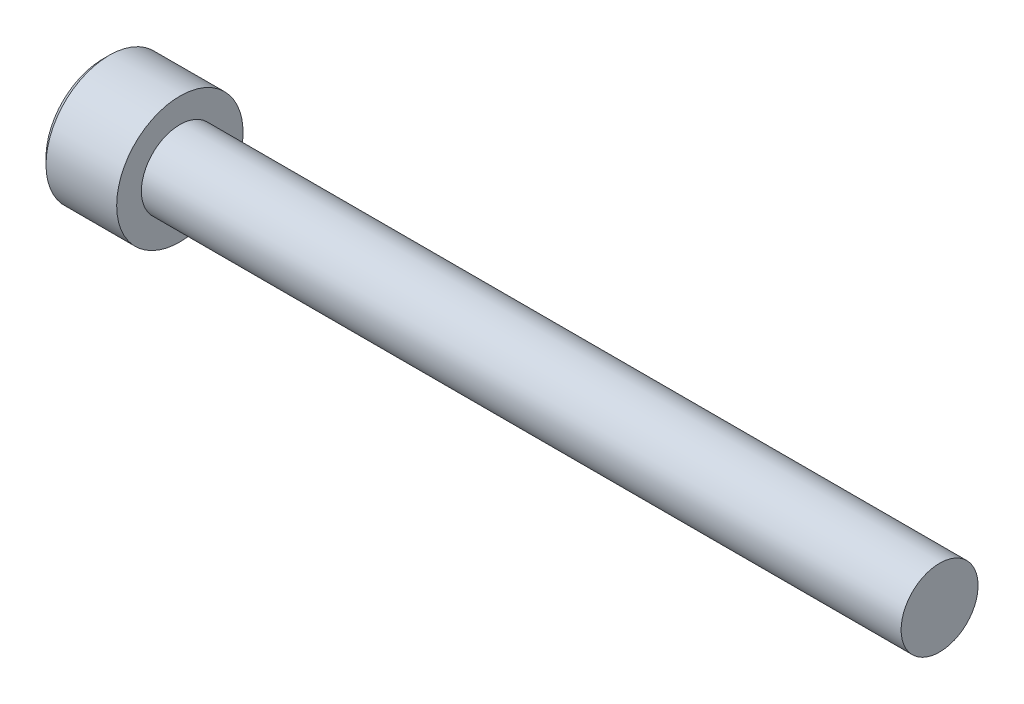
ISO-10303-21;
HEADER;
FILE_DESCRIPTION(('STEP AP214'),'2;1');
FILE_NAME('part.step','',(''),(''),'','','');
FILE_SCHEMA(('AUTOMOTIVE_DESIGN { 1 0 10303 214 1 1 1 1 }'));
ENDSEC;
DATA;
#1=APPLICATION_CONTEXT('core data for automotive mechanical design processes');
#2=APPLICATION_PROTOCOL_DEFINITION('international standard','automotive_design',2000,#1);
#3=PRODUCT_CONTEXT('',#1,'mechanical');
#4=PRODUCT('Part','Part','',(#3));
#5=PRODUCT_RELATED_PRODUCT_CATEGORY('part','',(#4));
#6=PRODUCT_DEFINITION_FORMATION('','',#4);
#7=PRODUCT_DEFINITION_CONTEXT('part definition',#1,'design');
#8=PRODUCT_DEFINITION('design','',#6,#7);
#9=PRODUCT_DEFINITION_SHAPE('','',#8);
#10=(LENGTH_UNIT() NAMED_UNIT(*) SI_UNIT(.MILLI.,.METRE.));
#11=(NAMED_UNIT(*) PLANE_ANGLE_UNIT() SI_UNIT($,.RADIAN.));
#12=(NAMED_UNIT(*) SI_UNIT($,.STERADIAN.) SOLID_ANGLE_UNIT());
#13=UNCERTAINTY_MEASURE_WITH_UNIT(LENGTH_MEASURE(1.E-05),#10,'distance_accuracy_value','');
#14=(GEOMETRIC_REPRESENTATION_CONTEXT(3) GLOBAL_UNCERTAINTY_ASSIGNED_CONTEXT((#13)) GLOBAL_UNIT_ASSIGNED_CONTEXT((#10,
#11,#12)) REPRESENTATION_CONTEXT('',''));
#15=CARTESIAN_POINT('',(0.,0.,0.));
#16=DIRECTION('',(0.,0.,1.));
#17=DIRECTION('',(1.,0.,0.));
#18=AXIS2_PLACEMENT_3D('',#15,#16,#17);
#19=CARTESIAN_POINT('',(-2.28600000000007,-1.14567944042317,1.984375));
#20=DIRECTION('',(0.,0.,1.));
#21=DIRECTION('',(1.,0.,0.));
#22=AXIS2_PLACEMENT_3D('',#19,#20,#21);
#23=PLANE('',#22);
#24=CARTESIAN_POINT('',(-4.82599999995852,1.14567944044653,1.98437499999554));
#25=CARTESIAN_POINT('',(-4.78691618362732,1.06743880343266,1.9843749999984));
#26=CARTESIAN_POINT('',(-4.75011447684892,0.987898318960917,1.98437499999957));
#27=CARTESIAN_POINT('',(-4.68265620500518,0.825677042028778,1.98437500000043));
#28=CARTESIAN_POINT('',(-4.65204056061138,0.742979382529199,1.98437500000012));
#29=CARTESIAN_POINT('',(-4.5991739228306,0.575193959555969,1.98437499999988));
#30=CARTESIAN_POINT('',(-4.57689462080725,0.490115359117279,1.98437499999997));
#31=CARTESIAN_POINT('',(-4.54259467221837,0.318093091130193,1.98437500000003));
#32=CARTESIAN_POINT('',(-4.5305423022885,0.231156054976726,1.984375));
#33=CARTESIAN_POINT('',(-4.52249110263747,0.119918521511051,1.984375));
#34=CARTESIAN_POINT('',(-4.52118947557477,0.0959468443046798,1.984375));
#35=CARTESIAN_POINT('',(-4.51945182629813,0.0479845644411998,1.984375));
#36=CARTESIAN_POINT('',(-4.51901533386223,0.0239939791589393,1.984375));
#37=CARTESIAN_POINT('',(-4.51901809008399,-0.0602201717457363,1.984375));
#38=CARTESIAN_POINT('',(-4.52177452299902,-0.120461721905447,1.984375));
#39=CARTESIAN_POINT('',(-4.5326365512493,-0.240474970989197,1.984375));
#40=CARTESIAN_POINT('',(-4.54074587749718,-0.300246312758427,1.984375));
#41=CARTESIAN_POINT('',(-4.57259622946939,-0.478763752804282,1.984375));
#42=CARTESIAN_POINT('',(-4.60385422611702,-0.596208828937734,1.984375));
#43=CARTESIAN_POINT('',(-4.66780003592237,-0.785921487441256,1.984375));
#44=CARTESIAN_POINT('',(-4.69623457768558,-0.859734609866899,1.984375));
#45=CARTESIAN_POINT('',(-4.75786140400812,-1.00456595519282,1.984375));
#46=CARTESIAN_POINT('',(-4.79100779300359,-1.07560356657101,1.984375));
#47=CARTESIAN_POINT('',(-4.82599999995643,-1.14567944044724,1.984375));
#48=B_SPLINE_CURVE_WITH_KNOTS('',3,(#24,#25,#26,#27,#28,#29,#30,#31,#32,#33,#34,#35,#36,#37,#38,
#39,#40,#41,#42,#43,#44,#45,#46,#47),.UNSPECIFIED.,.F.,.F.,(4,2,2,2,2,2,2,2,2,2,2,4),(0.,
0.262559005207405,0.526801735838036,0.790138824405318,1.05265603861765,1.12466619182083,
1.19663719499031,1.3772702672652,1.55802937209382,1.92104085090328,2.15819130092264,
2.39317265078575),.UNSPECIFIED.);
#49=CARTESIAN_POINT('',(-4.82599999996829,1.14567944041753,1.98437500003084));
#50=VERTEX_POINT('',#49);
#51=CARTESIAN_POINT('',(-4.8259999999622,-1.14567944043207,1.98437500001542));
#52=VERTEX_POINT('',#51);
#53=EDGE_CURVE('E20',#50,#52,#48,.T.);
#54=ORIENTED_EDGE('',*,*,#53,.F.);
#55=DIRECTION('',(1.,0.,0.));
#56=VECTOR('',#55,1.);
#57=CARTESIAN_POINT('',(-2.28600000000007,1.14567944042316,1.984375));
#58=LINE('',#57,#56);
#59=CARTESIAN_POINT('',(-2.28600000000007,1.14567944042316,1.984375));
#60=VERTEX_POINT('',#59);
#61=EDGE_CURVE('E68',#50,#60,#58,.T.);
#62=ORIENTED_EDGE('',*,*,#61,.T.);
#63=DIRECTION('',(0.,1.,0.));
#64=VECTOR('',#63,1.);
#65=CARTESIAN_POINT('',(-2.28600000000007,0.,1.984375));
#66=LINE('',#65,#64);
#67=CARTESIAN_POINT('',(-2.28600000000007,-1.14567944042317,1.984375));
#68=VERTEX_POINT('',#67);
#69=EDGE_CURVE('E74',#68,#60,#66,.T.);
#70=ORIENTED_EDGE('',*,*,#69,.F.);
#71=DIRECTION('',(1.,0.,0.));
#72=VECTOR('',#71,1.);
#73=CARTESIAN_POINT('',(-2.28600000000007,-1.14567944042317,1.984375));
#74=LINE('',#73,#72);
#75=EDGE_CURVE('E71',#68,#52,#74,.F.);
#76=ORIENTED_EDGE('',*,*,#75,.T.);
#77=EDGE_LOOP('',(#54,#62,#70,#76));
#78=FACE_BOUND('',#77,.T.);
#79=ADVANCED_FACE('F16',(#78),#23,.F.);
#80=CARTESIAN_POINT('',(-2.28600000000007,0.,0.));
#81=DIRECTION('',(-1.,0.,0.));
#82=DIRECTION('',(0.,0.,1.));
#83=AXIS2_PLACEMENT_3D('',#80,#81,#82);
#84=PLANE('',#83);
#85=DIRECTION('',(0.,0.5,0.866025403784439));
#86=VECTOR('',#85,1.);
#87=CARTESIAN_POINT('',(-2.28600000000007,2.29135888084633,0.));
#88=LINE('',#87,#86);
#89=CARTESIAN_POINT('',(-2.28600000000007,2.29135888084633,0.));
#90=VERTEX_POINT('',#89);
#91=CARTESIAN_POINT('',(-2.28600000000007,1.14567944042316,-1.984375));
#92=VERTEX_POINT('',#91);
#93=EDGE_CURVE('E82',#90,#92,#88,.F.);
#94=ORIENTED_EDGE('',*,*,#93,.T.);
#95=DIRECTION('',(0.,1.,0.));
#96=VECTOR('',#95,1.);
#97=CARTESIAN_POINT('',(-2.28600000000007,1.14567944042316,-1.984375));
#98=LINE('',#97,#96);
#99=CARTESIAN_POINT('',(-2.28600000000007,-1.14567944042316,-1.984375));
#100=VERTEX_POINT('',#99);
#101=EDGE_CURVE('E242',#92,#100,#98,.F.);
#102=ORIENTED_EDGE('',*,*,#101,.T.);
#103=DIRECTION('',(0.,0.5,-0.866025403784439));
#104=VECTOR('',#103,1.);
#105=CARTESIAN_POINT('',(-2.28600000000007,-1.14567944042316,-1.984375));
#106=LINE('',#105,#104);
#107=CARTESIAN_POINT('',(-2.28600000000007,-2.29135888084633,0.));
#108=VERTEX_POINT('',#107);
#109=EDGE_CURVE('E227',#100,#108,#106,.F.);
#110=ORIENTED_EDGE('',*,*,#109,.T.);
#111=DIRECTION('',(0.,-0.5,-0.866025403784439));
#112=VECTOR('',#111,1.);
#113=CARTESIAN_POINT('',(-2.28600000000007,-2.29135888084633,0.));
#114=LINE('',#113,#112);
#115=EDGE_CURVE('E224',#108,#68,#114,.F.);
#116=ORIENTED_EDGE('',*,*,#115,.T.);
#117=ORIENTED_EDGE('',*,*,#69,.T.);
#118=DIRECTION('',(0.,-0.5,0.866025403784439));
#119=VECTOR('',#118,1.);
#120=CARTESIAN_POINT('',(-2.28600000000007,1.14567944042316,1.984375));
#121=LINE('',#120,#119);
#122=EDGE_CURVE('E81',#60,#90,#121,.F.);
#123=ORIENTED_EDGE('',*,*,#122,.T.);
#124=EDGE_LOOP('',(#94,#102,#110,#116,#117,#123));
#125=FACE_BOUND('',#124,.T.);
#126=ADVANCED_FACE('F160',(#125),#84,.T.);
#127=CARTESIAN_POINT('',(-2.28600000000007,-1.14567944042316,-1.984375));
#128=DIRECTION('',(0.,-0.866025403784439,-0.5));
#129=DIRECTION('',(0.,0.5,-0.866025403784439));
#130=AXIS2_PLACEMENT_3D('',#127,#128,#129);
#131=PLANE('',#130);
#132=CARTESIAN_POINT('',(-4.82599999995871,-1.14567944040756,-1.98437500001887));
#133=CARTESIAN_POINT('',(-4.78666022792997,-1.18505700230148,-1.91617106214563));
#134=CARTESIAN_POINT('',(-4.74963132844072,-1.22509295783734,-1.8468267530301));
#135=CARTESIAN_POINT('',(-4.68183299424977,-1.30673037975396,-1.70542659047317));
#136=CARTESIAN_POINT('',(-4.65110127019237,-1.34833960561553,-1.63335729721673));
#137=CARTESIAN_POINT('',(-4.59845762010516,-1.432242568594,-1.48803310243203));
#138=CARTESIAN_POINT('',(-4.57641341195893,-1.47451494967301,-1.41481519064643));
#139=CARTESIAN_POINT('',(-4.54245011067441,-1.55999007976842,-1.26676792253773));
#140=CARTESIAN_POINT('',(-4.53050567471972,-1.6031902195197,-1.19194308559438));
#141=CARTESIAN_POINT('',(-4.51972842752365,-1.67764765054852,-1.06297903205139));
#142=CARTESIAN_POINT('',(-4.51813352794834,-1.70880881707173,-1.00900630841009));
#143=CARTESIAN_POINT('',(-4.52082392138599,-1.77108016542046,-0.901149169214274));
#144=CARTESIAN_POINT('',(-4.52511127545884,-1.80219032554946,-0.847264791239237));
#145=CARTESIAN_POINT('',(-4.53932219421538,-1.86411684097343,-0.740004920189235));
#146=CARTESIAN_POINT('',(-4.54925206045723,-1.8949328285454,-0.686630064029166));
#147=CARTESIAN_POINT('',(-4.5742029484467,-1.95603190279815,-0.580803363127978));
#148=CARTESIAN_POINT('',(-4.58922357974385,-1.98631503016081,-0.528351447923769));
#149=CARTESIAN_POINT('',(-4.63380478900425,-2.06386502548479,-0.394030915895904));
#150=CARTESIAN_POINT('',(-4.66672213384104,-2.11065153226583,-0.312994309042484));
#151=CARTESIAN_POINT('',(-4.72228952038986,-2.17944749410732,-0.193836207777459));
#152=CARTESIAN_POINT('',(-4.74181309375939,-2.20211890802843,-0.154568166986659));
#153=CARTESIAN_POINT('',(-4.78263970065987,-2.24704195201531,-0.0767591723707469));
#154=CARTESIAN_POINT('',(-4.80394164363173,-2.2692938292399,-0.0382177904539708));
#155=CARTESIAN_POINT('',(-4.82599999995675,-2.29135888085868,2.13931096265935E-11));
#156=B_SPLINE_CURVE_WITH_KNOTS('',3,(#132,#133,#134,#135,#136,#137,#138,#139,#140,#141,#142,
#143,#144,#145,#146,#147,#148,#149,#150,#151,#152,#153,#154,#155),.UNSPECIFIED.,.F.,.F.,(4,2,2,
2,2,2,2,2,2,2,2,4),(0.,0.264284909626495,0.530108996358094,0.791712695414128,1.05265800174404,
1.23942150116703,1.42625045663858,1.61328847394198,1.80031214908683,2.09727151182814,
2.24534838946042,2.39333511890876),.UNSPECIFIED.);
#157=CARTESIAN_POINT('',(-4.8259999999622,-1.14567944043207,-1.98437500001542));
#158=VERTEX_POINT('',#157);
#159=CARTESIAN_POINT('',(-4.82599999996846,-2.2913588808704,-2.00043543490866E-11));
#160=VERTEX_POINT('',#159);
#161=EDGE_CURVE('E162',#158,#160,#156,.T.);
#162=ORIENTED_EDGE('',*,*,#161,.T.);
#163=DIRECTION('',(1.,0.,0.));
#164=VECTOR('',#163,1.);
#165=CARTESIAN_POINT('',(-2.28600000000007,-2.29135888084633,0.));
#166=LINE('',#165,#164);
#167=EDGE_CURVE('E235',#160,#108,#166,.T.);
#168=ORIENTED_EDGE('',*,*,#167,.T.);
#169=ORIENTED_EDGE('',*,*,#109,.F.);
#170=DIRECTION('',(-1.,0.,0.));
#171=VECTOR('',#170,1.);
#172=CARTESIAN_POINT('',(-2.28600000000007,-1.14567944042316,-1.984375));
#173=LINE('',#172,#171);
#174=EDGE_CURVE('E245',#100,#158,#173,.T.);
#175=ORIENTED_EDGE('',*,*,#174,.T.);
#176=EDGE_LOOP('',(#162,#168,#169,#175));
#177=FACE_BOUND('',#176,.T.);
#178=ADVANCED_FACE('F156',(#177),#131,.F.);
#179=CARTESIAN_POINT('',(-2.28600000000007,-2.29135888084633,0.));
#180=DIRECTION('',(0.,-0.866025403784439,0.5));
#181=DIRECTION('',(0.,-0.5,-0.866025403784439));
#182=AXIS2_PLACEMENT_3D('',#179,#180,#181);
#183=PLANE('',#182);
#184=CARTESIAN_POINT('',(-4.8259999999587,-2.29135888085486,-2.29477011545215E-11));
#185=CARTESIAN_POINT('',(-4.78666022792997,-2.25198131896546,0.0682039378529047));
#186=CARTESIAN_POINT('',(-4.74963132844072,-2.21194536343147,0.137548246969502));
#187=CARTESIAN_POINT('',(-4.68183299424977,-2.13030794151622,0.278948409527228));
#188=CARTESIAN_POINT('',(-4.65110127019237,-2.08869871565414,0.351017702783377));
#189=CARTESIAN_POINT('',(-4.59845762010516,-2.00479575267531,0.496341897567867));
#190=CARTESIAN_POINT('',(-4.57641341195893,-1.96252337159644,0.569559809353539));
#191=CARTESIAN_POINT('',(-4.5424501106744,-1.87704824150112,0.717607077462299));
#192=CARTESIAN_POINT('',(-4.53050567471972,-1.8338481017498,0.792431914405622));
#193=CARTESIAN_POINT('',(-4.51972842752365,-1.75939067072096,0.921395967948603));
#194=CARTESIAN_POINT('',(-4.51813352794834,-1.72822950419776,0.975368691589913));
#195=CARTESIAN_POINT('',(-4.52082392138599,-1.66595815584903,1.08322583078573));
#196=CARTESIAN_POINT('',(-4.52511127545884,-1.63484799572003,1.13711020876076));
#197=CARTESIAN_POINT('',(-4.53932219421538,-1.57292148029607,1.24437007981077));
#198=CARTESIAN_POINT('',(-4.54925206045723,-1.54210549272409,1.29774493597084));
#199=CARTESIAN_POINT('',(-4.5742029484467,-1.48100641847134,1.40357163687202));
#200=CARTESIAN_POINT('',(-4.58922357974385,-1.45072329110868,1.45602355207623));
#201=CARTESIAN_POINT('',(-4.63380478900421,-1.37317329578476,1.59034408410398));
#202=CARTESIAN_POINT('',(-4.66672213384095,-1.32638678900379,1.6713806909573));
#203=CARTESIAN_POINT('',(-4.72228952038968,-1.25759082716239,1.79053879222216));
#204=CARTESIAN_POINT('',(-4.74181309375917,-1.23491941324131,1.82980683301291));
#205=CARTESIAN_POINT('',(-4.78263970065959,-1.18999636925449,1.90761582762873));
#206=CARTESIAN_POINT('',(-4.8039416436314,-1.16774449202993,1.94615720954545));
#207=CARTESIAN_POINT('',(-4.82599999995639,-1.14567944041117,1.98437500002077));
#208=B_SPLINE_CURVE_WITH_KNOTS('',3,(#184,#185,#186,#187,#188,#189,#190,#191,#192,#193,#194,
#195,#196,#197,#198,#199,#200,#201,#202,#203,#204,#205,#206,#207),.UNSPECIFIED.,.F.,.F.,(4,2,2,
2,2,2,2,2,2,2,2,4),(0.,0.264284909626493,0.530108996358089,0.791712695414125,1.05265800174404,
1.23942150116703,1.42625045663858,1.61328847394198,1.80031214908683,2.09727151182773,
2.24534838945981,2.39333511890795),.UNSPECIFIED.);
#209=EDGE_CURVE('E91',#160,#52,#208,.T.);
#210=ORIENTED_EDGE('',*,*,#209,.T.);
#211=ORIENTED_EDGE('',*,*,#75,.F.);
#212=ORIENTED_EDGE('',*,*,#115,.F.);
#213=ORIENTED_EDGE('',*,*,#167,.F.);
#214=EDGE_LOOP('',(#210,#211,#212,#213));
#215=FACE_BOUND('',#214,.T.);
#216=ADVANCED_FACE('F151',(#215),#183,.F.);
#217=CARTESIAN_POINT('',(-2.28600000000007,1.14567944042316,1.984375));
#218=DIRECTION('',(0.,0.866025403784439,0.5));
#219=DIRECTION('',(0.,-0.5,0.866025403784439));
#220=AXIS2_PLACEMENT_3D('',#217,#218,#219);
#221=PLANE('',#220);
#222=CARTESIAN_POINT('',(-4.82599999995852,1.14567944040762,1.98437500001801));
#223=CARTESIAN_POINT('',(-4.78666022792973,1.1850570023017,1.91617106214498));
#224=CARTESIAN_POINT('',(-4.74963132844047,1.22509295783761,1.84682675302957));
#225=CARTESIAN_POINT('',(-4.68183299424957,1.30673037975422,1.70542659047278));
#226=CARTESIAN_POINT('',(-4.65110127019222,1.34833960561574,1.63335729721638));
#227=CARTESIAN_POINT('',(-4.59845762010509,1.43224256859413,1.48803310243178));
#228=CARTESIAN_POINT('',(-4.57641341195888,1.47451494967311,1.41481519064625));
#229=CARTESIAN_POINT('',(-4.54245011067439,1.55999007976846,1.26676792253767));
#230=CARTESIAN_POINT('',(-4.53050567471972,1.6031902195197,1.19194308559439));
#231=CARTESIAN_POINT('',(-4.51972842752365,1.67764765054848,1.06297903205146));
#232=CARTESIAN_POINT('',(-4.51813352794835,1.70880881707169,1.00900630841016));
#233=CARTESIAN_POINT('',(-4.52082392138598,1.77108016542041,0.901149169214364));
#234=CARTESIAN_POINT('',(-4.52511127545883,1.80219032554941,0.847264791239333));
#235=CARTESIAN_POINT('',(-4.53932219421536,1.86411684097336,0.740004920189342));
#236=CARTESIAN_POINT('',(-4.54925206045721,1.89493282854533,0.686630064029278));
#237=CARTESIAN_POINT('',(-4.57420294844667,1.95603190279808,0.5808033631281));
#238=CARTESIAN_POINT('',(-4.58922357974382,1.98631503016074,0.528351447923897));
#239=CARTESIAN_POINT('',(-4.6338047890042,2.06386502548473,0.394030915896012));
#240=CARTESIAN_POINT('',(-4.666722133841,2.11065153226578,0.312994309042568));
#241=CARTESIAN_POINT('',(-4.72228952038984,2.17944749410729,0.19383620777751));
#242=CARTESIAN_POINT('',(-4.74181309375937,2.20211890802841,0.1545681669867));
#243=CARTESIAN_POINT('',(-4.78263970065986,2.24704195201529,0.0767591723707674));
#244=CARTESIAN_POINT('',(-4.80394164363172,2.26929382923989,0.0382177904539813));
#245=CARTESIAN_POINT('',(-4.82599999995675,2.29135888085868,-2.1392886942985E-11));
#246=B_SPLINE_CURVE_WITH_KNOTS('',3,(#222,#223,#224,#225,#226,#227,#228,#229,#230,#231,#232,
#233,#234,#235,#236,#237,#238,#239,#240,#241,#242,#243,#244,#245),.UNSPECIFIED.,.F.,.F.,(4,2,2,
2,2,2,2,2,2,2,2,4),(0.,0.26428490962629,0.530108996357672,0.791712695413487,1.05265800174319,
1.23942150116616,1.42625045663768,1.61328847394106,1.80031214908589,2.09727151182728,
2.2453483894596,2.39333511890798),.UNSPECIFIED.);
#247=CARTESIAN_POINT('',(-4.82599999996846,2.29135888087039,2.00042061038936E-11));
#248=VERTEX_POINT('',#247);
#249=EDGE_CURVE('E79',#50,#248,#246,.T.);
#250=ORIENTED_EDGE('',*,*,#249,.T.);
#251=DIRECTION('',(1.,0.,0.));
#252=VECTOR('',#251,1.);
#253=CARTESIAN_POINT('',(-2.28600000000007,2.29135888084633,0.));
#254=LINE('',#253,#252);
#255=EDGE_CURVE('E246',#248,#90,#254,.T.);
#256=ORIENTED_EDGE('',*,*,#255,.T.);
#257=ORIENTED_EDGE('',*,*,#122,.F.);
#258=ORIENTED_EDGE('',*,*,#61,.F.);
#259=EDGE_LOOP('',(#250,#256,#257,#258));
#260=FACE_BOUND('',#259,.T.);
#261=ADVANCED_FACE('F76',(#260),#221,.F.);
#262=CARTESIAN_POINT('',(-2.28600000000007,2.29135888084633,0.));
#263=DIRECTION('',(0.,0.866025403784439,-0.5));
#264=DIRECTION('',(0.,0.5,0.866025403784439));
#265=AXIS2_PLACEMENT_3D('',#262,#263,#264);
#266=PLANE('',#265);
#267=CARTESIAN_POINT('',(-4.82599999995871,2.29135888085486,2.29489280696874E-11));
#268=CARTESIAN_POINT('',(-4.78666022792997,2.25198131896547,-0.0682039378529039));
#269=CARTESIAN_POINT('',(-4.74963132844072,2.21194536343147,-0.137548246969502));
#270=CARTESIAN_POINT('',(-4.68183299424977,2.13030794151622,-0.278948409527229));
#271=CARTESIAN_POINT('',(-4.65110127019237,2.08869871565414,-0.351017702783379));
#272=CARTESIAN_POINT('',(-4.59845762010516,2.00479575267531,-0.496341897567869));
#273=CARTESIAN_POINT('',(-4.57641341195893,1.96252337159644,-0.569559809353541));
#274=CARTESIAN_POINT('',(-4.5424501106744,1.87704824150112,-0.7176070774623));
#275=CARTESIAN_POINT('',(-4.53050567471972,1.8338481017498,-0.792431914405622));
#276=CARTESIAN_POINT('',(-4.51972842752365,1.75939067072096,-0.921395967948603));
#277=CARTESIAN_POINT('',(-4.51813352794834,1.72822950419776,-0.975368691589912));
#278=CARTESIAN_POINT('',(-4.52082392138599,1.66595815584903,-1.08322583078573));
#279=CARTESIAN_POINT('',(-4.52511127545884,1.63484799572003,-1.13711020876076));
#280=CARTESIAN_POINT('',(-4.53932219421538,1.57292148029607,-1.24437007981077));
#281=CARTESIAN_POINT('',(-4.54925206045723,1.54210549272409,-1.29774493597083));
#282=CARTESIAN_POINT('',(-4.5742029484467,1.48100641847134,-1.40357163687202));
#283=CARTESIAN_POINT('',(-4.58922357974385,1.45072329110868,-1.45602355207623));
#284=CARTESIAN_POINT('',(-4.63380478900425,1.3731732957847,-1.5903440841041));
#285=CARTESIAN_POINT('',(-4.66672213384104,1.32638678900366,-1.67138069095752));
#286=CARTESIAN_POINT('',(-4.72228952038986,1.25759082716218,-1.79053879222254));
#287=CARTESIAN_POINT('',(-4.74181309375939,1.23491941324106,-1.82980683301334));
#288=CARTESIAN_POINT('',(-4.78263970065987,1.18999636925419,-1.90761582762925));
#289=CARTESIAN_POINT('',(-4.80394164363173,1.1677444920296,-1.94615720954603));
#290=CARTESIAN_POINT('',(-4.82599999995675,1.14567944041081,-1.98437500002139));
#291=B_SPLINE_CURVE_WITH_KNOTS('',3,(#267,#268,#269,#270,#271,#272,#273,#274,#275,#276,#277,
#278,#279,#280,#281,#282,#283,#284,#285,#286,#287,#288,#289,#290),.UNSPECIFIED.,.F.,.F.,(4,2,2,
2,2,2,2,2,2,2,2,4),(0.,0.264284909626495,0.530108996358093,0.791712695414127,1.05265800174404,
1.23942150116703,1.42625045663858,1.61328847394198,1.80031214908683,2.09727151182814,
2.24534838946042,2.39333511890876),.UNSPECIFIED.);
#292=CARTESIAN_POINT('',(-4.82599999996846,1.14567944045252,-1.98437500001084));
#293=VERTEX_POINT('',#292);
#294=EDGE_CURVE('E39',#248,#293,#291,.T.);
#295=ORIENTED_EDGE('',*,*,#294,.T.);
#296=DIRECTION('',(-1.,0.,0.));
#297=VECTOR('',#296,1.);
#298=CARTESIAN_POINT('',(-2.28600000000007,1.14567944042316,-1.984375));
#299=LINE('',#298,#297);
#300=EDGE_CURVE('E166',#293,#92,#299,.F.);
#301=ORIENTED_EDGE('',*,*,#300,.T.);
#302=ORIENTED_EDGE('',*,*,#93,.F.);
#303=ORIENTED_EDGE('',*,*,#255,.F.);
#304=EDGE_LOOP('',(#295,#301,#302,#303));
#305=FACE_BOUND('',#304,.T.);
#306=ADVANCED_FACE('F150',(#305),#266,.F.);
#307=CARTESIAN_POINT('',(-2.28600000000007,1.14567944042316,-1.984375));
#308=DIRECTION('',(0.,0.,-1.));
#309=DIRECTION('',(-1.,0.,0.));
#310=AXIS2_PLACEMENT_3D('',#307,#308,#309);
#311=PLANE('',#310);
#312=CARTESIAN_POINT('',(-4.8259999999587,1.14567944044731,-1.98437499999592));
#313=CARTESIAN_POINT('',(-4.78666022793094,1.06692431665146,-1.98437499999853));
#314=CARTESIAN_POINT('',(-4.74963132844318,0.986852405569011,-1.98437499999961));
#315=CARTESIAN_POINT('',(-4.6818329942566,0.823577561711963,-1.9843750000004));
#316=CARTESIAN_POINT('',(-4.65110127020207,0.740359109975722,-1.98437500000011));
#317=CARTESIAN_POINT('',(-4.59845762012233,0.572553183993917,-1.9843749999999));
#318=CARTESIAN_POINT('',(-4.57641341198063,0.488008421824127,-1.98437499999997));
#319=CARTESIAN_POINT('',(-4.54245011070673,0.317058161610178,-1.98437500000003));
#320=CARTESIAN_POINT('',(-4.53050567475816,0.230657882096267,-1.98437500000001));
#321=CARTESIAN_POINT('',(-4.51972842757294,0.0817430200124032,-1.984375));
#322=CARTESIAN_POINT('',(-4.51813352800283,0.0194206869508218,-1.984375));
#323=CARTESIAN_POINT('',(-4.52082392145254,-0.1051220097764,-1.984375));
#324=CARTESIAN_POINT('',(-4.52511127553227,-0.167342330049008,-1.984375));
#325=CARTESIAN_POINT('',(-4.53932219430377,-0.291195360925477,-1.984375));
#326=CARTESIAN_POINT('',(-4.54925206055372,-0.352827336083362,-1.984375));
#327=CARTESIAN_POINT('',(-4.57420294856008,-0.475025484616114,-1.984375));
#328=CARTESIAN_POINT('',(-4.58922357986604,-0.535591739354747,-1.984375));
#329=CARTESIAN_POINT('',(-4.63380478912724,-0.690691729958653,-1.984375));
#330=CARTESIAN_POINT('',(-4.66672213394715,-0.784264743465576,-1.984375));
#331=CARTESIAN_POINT('',(-4.7222895204619,-0.921856667069616,-1.984375));
#332=CARTESIAN_POINT('',(-4.74181309381856,-0.967199494886089,-1.984375));
#333=CARTESIAN_POINT('',(-4.78263970069104,-1.05704558280959,-1.984375));
#334=CARTESIAN_POINT('',(-4.80394164364776,-1.10154933723428,-1.984375));
#335=CARTESIAN_POINT('',(-4.82599999995675,-1.14567944044787,-1.984375));
#336=B_SPLINE_CURVE_WITH_KNOTS('',3,(#312,#313,#314,#315,#316,#317,#318,#319,#320,#321,#322,
#323,#324,#325,#326,#327,#328,#329,#330,#331,#332,#333,#334,#335),.UNSPECIFIED.,.F.,.F.,(4,2,2,
2,2,2,2,2,2,2,2,4),(0.,0.264284909658836,0.530108996422784,0.791712695509868,1.0526580018708,
1.23942150133878,1.42625045685537,1.61328847420389,1.80031214939384,2.09727151196384,
2.24534838950992,2.39333511887245),.UNSPECIFIED.);
#337=EDGE_CURVE('E108',#293,#158,#336,.T.);
#338=ORIENTED_EDGE('',*,*,#337,.T.);
#339=ORIENTED_EDGE('',*,*,#174,.F.);
#340=ORIENTED_EDGE('',*,*,#101,.F.);
#341=ORIENTED_EDGE('',*,*,#300,.F.);
#342=EDGE_LOOP('',(#338,#339,#340,#341));
#343=FACE_BOUND('',#342,.T.);
#344=ADVANCED_FACE('F121',(#343),#311,.F.);
#345=CARTESIAN_POINT('',(-4.82599999998001,0.,0.));
#346=DIRECTION('',(-1.,0.,0.));
#347=DIRECTION('',(0.,0.,1.));
#348=AXIS2_PLACEMENT_3D('',#345,#346,#347);
#349=CONICAL_SURFACE('',#348,2.29135888088194,0.785398163397448);
#350=ORIENTED_EDGE('',*,*,#161,.F.);
#351=CARTESIAN_POINT('',(-4.82599999998001,0.,0.));
#352=DIRECTION('',(-1.,0.,0.));
#353=DIRECTION('',(0.,0.,1.));
#354=AXIS2_PLACEMENT_3D('',#351,#352,#353);
#355=CIRCLE('',#354,2.29135888088194);
#356=EDGE_CURVE('E105',#158,#160,#355,.T.);
#357=ORIENTED_EDGE('',*,*,#356,.T.);
#358=EDGE_LOOP('',(#350,#357));
#359=FACE_BOUND('',#358,.T.);
#360=ADVANCED_FACE('F167',(#359),#349,.F.);
#361=CARTESIAN_POINT('',(-4.82599999998001,0.,0.));
#362=DIRECTION('',(-1.,0.,0.));
#363=DIRECTION('',(0.,0.,1.));
#364=AXIS2_PLACEMENT_3D('',#361,#362,#363);
#365=CONICAL_SURFACE('',#364,2.29135888088194,0.785398163397448);
#366=ORIENTED_EDGE('',*,*,#209,.F.);
#367=CARTESIAN_POINT('',(-4.82599999998001,0.,0.));
#368=DIRECTION('',(-1.,0.,0.));
#369=DIRECTION('',(0.,0.,1.));
#370=AXIS2_PLACEMENT_3D('',#367,#368,#369);
#371=CIRCLE('',#370,2.29135888088194);
#372=EDGE_CURVE('E86',#160,#52,#371,.T.);
#373=ORIENTED_EDGE('',*,*,#372,.T.);
#374=EDGE_LOOP('',(#366,#373));
#375=FACE_BOUND('',#374,.T.);
#376=ADVANCED_FACE('F170',(#375),#365,.F.);
#377=CARTESIAN_POINT('',(-4.82599999998001,0.,0.));
#378=DIRECTION('',(-1.,0.,0.));
#379=DIRECTION('',(0.,0.,1.));
#380=AXIS2_PLACEMENT_3D('',#377,#378,#379);
#381=CONICAL_SURFACE('',#380,2.29135888088194,0.78539816348948);
#382=CARTESIAN_POINT('',(-4.82599999998001,0.,0.));
#383=DIRECTION('',(-1.,0.,0.));
#384=DIRECTION('',(0.,0.,1.));
#385=AXIS2_PLACEMENT_3D('',#382,#383,#384);
#386=CIRCLE('',#385,2.29135888088194);
#387=EDGE_CURVE('E59',#52,#50,#386,.T.);
#388=ORIENTED_EDGE('',*,*,#387,.T.);
#389=ORIENTED_EDGE('',*,*,#53,.T.);
#390=EDGE_LOOP('',(#388,#389));
#391=FACE_BOUND('',#390,.T.);
#392=ADVANCED_FACE('F84',(#391),#381,.F.);
#393=CARTESIAN_POINT('',(-4.82599999998001,0.,0.));
#394=DIRECTION('',(-1.,0.,0.));
#395=DIRECTION('',(0.,0.,1.));
#396=AXIS2_PLACEMENT_3D('',#393,#394,#395);
#397=CONICAL_SURFACE('',#396,2.29135888088194,0.785398163397448);
#398=ORIENTED_EDGE('',*,*,#249,.F.);
#399=CARTESIAN_POINT('',(-4.82599999998001,0.,0.));
#400=DIRECTION('',(-1.,0.,0.));
#401=DIRECTION('',(0.,0.,1.));
#402=AXIS2_PLACEMENT_3D('',#399,#400,#401);
#403=CIRCLE('',#402,2.29135888088194);
#404=EDGE_CURVE('E85',#50,#248,#403,.T.);
#405=ORIENTED_EDGE('',*,*,#404,.T.);
#406=EDGE_LOOP('',(#398,#405));
#407=FACE_BOUND('',#406,.T.);
#408=ADVANCED_FACE('F90',(#407),#397,.F.);
#409=CARTESIAN_POINT('',(-4.82599999998001,0.,0.));
#410=DIRECTION('',(-1.,0.,0.));
#411=DIRECTION('',(0.,0.,1.));
#412=AXIS2_PLACEMENT_3D('',#409,#410,#411);
#413=CONICAL_SURFACE('',#412,2.29135888088194,0.785398163397448);
#414=ORIENTED_EDGE('',*,*,#294,.F.);
#415=CARTESIAN_POINT('',(-4.82599999998001,0.,0.));
#416=DIRECTION('',(-1.,0.,0.));
#417=DIRECTION('',(0.,0.,1.));
#418=AXIS2_PLACEMENT_3D('',#415,#416,#417);
#419=CIRCLE('',#418,2.29135888088194);
#420=EDGE_CURVE('E97',#248,#293,#419,.T.);
#421=ORIENTED_EDGE('',*,*,#420,.T.);
#422=EDGE_LOOP('',(#414,#421));
#423=FACE_BOUND('',#422,.T.);
#424=ADVANCED_FACE('F128',(#423),#413,.F.);
#425=CARTESIAN_POINT('',(-4.82599999998001,0.,0.));
#426=DIRECTION('',(-1.,0.,0.));
#427=DIRECTION('',(0.,0.,1.));
#428=AXIS2_PLACEMENT_3D('',#425,#426,#427);
#429=CONICAL_SURFACE('',#428,2.29135888088194,0.785398163489476);
#430=ORIENTED_EDGE('',*,*,#337,.F.);
#431=CARTESIAN_POINT('',(-4.82599999998001,0.,0.));
#432=DIRECTION('',(-1.,0.,0.));
#433=DIRECTION('',(0.,0.,1.));
#434=AXIS2_PLACEMENT_3D('',#431,#432,#433);
#435=CIRCLE('',#434,2.29135888088194);
#436=EDGE_CURVE('E99',#293,#158,#435,.T.);
#437=ORIENTED_EDGE('',*,*,#436,.T.);
#438=EDGE_LOOP('',(#430,#437));
#439=FACE_BOUND('',#438,.T.);
#440=ADVANCED_FACE('F124',(#439),#429,.F.);
#441=CARTESIAN_POINT('',(-4.82600000000007,0.,0.));
#442=DIRECTION('',(1.,0.,0.));
#443=DIRECTION('',(0.,0.,-1.));
#444=AXIS2_PLACEMENT_3D('',#441,#442,#443);
#445=PLANE('',#444);
#446=CARTESIAN_POINT('',(-4.82599999998001,0.,0.));
#447=DIRECTION('',(1.,0.,0.));
#448=DIRECTION('',(0.,0.,-1.));
#449=AXIS2_PLACEMENT_3D('',#446,#447,#448);
#450=CIRCLE('',#449,3.56615999999121);
#451=CARTESIAN_POINT('',(-4.82599999998001,0.,-3.56615999999121));
#452=VERTEX_POINT('',#451);
#453=EDGE_CURVE('E212',#452,#452,#450,.T.);
#454=ORIENTED_EDGE('',*,*,#453,.F.);
#455=EDGE_LOOP('',(#454));
#456=FACE_BOUND('',#455,.T.);
#457=ORIENTED_EDGE('',*,*,#420,.F.);
#458=ORIENTED_EDGE('',*,*,#404,.F.);
#459=ORIENTED_EDGE('',*,*,#387,.F.);
#460=ORIENTED_EDGE('',*,*,#372,.F.);
#461=ORIENTED_EDGE('',*,*,#356,.F.);
#462=ORIENTED_EDGE('',*,*,#436,.F.);
#463=EDGE_LOOP('',(#457,#458,#459,#460,#461,#462));
#464=FACE_BOUND('',#463,.T.);
#465=ADVANCED_FACE('F94',(#456,#464),#445,.F.);
#466=CARTESIAN_POINT('',(-4.42976000010731,0.,0.));
#467=DIRECTION('',(1.,0.,0.));
#468=DIRECTION('',(0.,0.,-1.));
#469=AXIS2_PLACEMENT_3D('',#466,#467,#468);
#470=CONICAL_SURFACE('',#469,3.96239999986392,0.785398163397448);
#471=CARTESIAN_POINT('',(-4.42976000000007,0.,0.));
#472=DIRECTION('',(-1.,0.,0.));
#473=DIRECTION('',(0.,0.,1.));
#474=AXIS2_PLACEMENT_3D('',#471,#472,#473);
#475=CIRCLE('',#474,3.9624);
#476=CARTESIAN_POINT('',(-4.42976000000007,0.,3.9624));
#477=VERTEX_POINT('',#476);
#478=EDGE_CURVE('E209',#477,#477,#475,.F.);
#479=ORIENTED_EDGE('',*,*,#478,.F.);
#480=EDGE_LOOP('',(#479));
#481=FACE_BOUND('',#480,.T.);
#482=ORIENTED_EDGE('',*,*,#453,.T.);
#483=EDGE_LOOP('',(#482));
#484=FACE_BOUND('',#483,.T.);
#485=ADVANCED_FACE('F198',(#481,#484),#470,.T.);
#486=CARTESIAN_POINT('',(-4.82600000000008,0.,0.));
#487=DIRECTION('',(-1.,0.,0.));
#488=DIRECTION('',(0.,0.,1.));
#489=AXIS2_PLACEMENT_3D('',#486,#487,#488);
#490=CYLINDRICAL_SURFACE('',#489,3.9624);
#491=ORIENTED_EDGE('',*,*,#478,.T.);
#492=EDGE_LOOP('',(#491));
#493=FACE_BOUND('',#492,.T.);
#494=CARTESIAN_POINT('',(0.,0.,0.));
#495=DIRECTION('',(-1.,0.,0.));
#496=DIRECTION('',(0.,0.,1.));
#497=AXIS2_PLACEMENT_3D('',#494,#495,#496);
#498=CIRCLE('',#497,3.9624);
#499=CARTESIAN_POINT('',(0.,0.,3.9624));
#500=VERTEX_POINT('',#499);
#501=EDGE_CURVE('E214',#500,#500,#498,.T.);
#502=ORIENTED_EDGE('',*,*,#501,.T.);
#503=EDGE_LOOP('',(#502));
#504=FACE_BOUND('',#503,.T.);
#505=ADVANCED_FACE('F195',(#493,#504),#490,.T.);
#506=CARTESIAN_POINT('',(47.625,0.,0.));
#507=DIRECTION('',(1.,0.,0.));
#508=DIRECTION('',(0.,0.,-1.));
#509=AXIS2_PLACEMENT_3D('',#506,#507,#508);
#510=PLANE('',#509);
#511=CARTESIAN_POINT('',(47.625,0.,0.));
#512=DIRECTION('',(-1.,0.,0.));
#513=DIRECTION('',(0.,0.,1.));
#514=AXIS2_PLACEMENT_3D('',#511,#512,#513);
#515=CIRCLE('',#514,2.413);
#516=CARTESIAN_POINT('',(47.625,0.,2.413));
#517=VERTEX_POINT('',#516);
#518=EDGE_CURVE('E30',#517,#517,#515,.T.);
#519=ORIENTED_EDGE('',*,*,#518,.F.);
#520=EDGE_LOOP('',(#519));
#521=FACE_BOUND('',#520,.T.);
#522=ADVANCED_FACE('F188',(#521),#510,.T.);
#523=CARTESIAN_POINT('',(0.,3.9624,0.));
#524=DIRECTION('',(-1.,0.,0.));
#525=DIRECTION('',(0.,0.,1.));
#526=AXIS2_PLACEMENT_3D('',#523,#524,#525);
#527=PLANE('',#526);
#528=CARTESIAN_POINT('',(0.,0.,0.));
#529=DIRECTION('',(-1.,0.,0.));
#530=DIRECTION('',(0.,0.,1.));
#531=AXIS2_PLACEMENT_3D('',#528,#529,#530);
#532=CIRCLE('',#531,2.413);
#533=CARTESIAN_POINT('',(0.,0.,2.413));
#534=VERTEX_POINT('',#533);
#535=EDGE_CURVE('E11',#534,#534,#532,.F.);
#536=ORIENTED_EDGE('',*,*,#535,.F.);
#537=EDGE_LOOP('',(#536));
#538=FACE_BOUND('',#537,.T.);
#539=ORIENTED_EDGE('',*,*,#501,.F.);
#540=EDGE_LOOP('',(#539));
#541=FACE_BOUND('',#540,.T.);
#542=ADVANCED_FACE('F182',(#538,#541),#527,.F.);
#543=CARTESIAN_POINT('',(47.625,0.,0.));
#544=DIRECTION('',(-1.,0.,0.));
#545=DIRECTION('',(0.,0.,1.));
#546=AXIS2_PLACEMENT_3D('',#543,#544,#545);
#547=CYLINDRICAL_SURFACE('',#546,2.413);
#548=ORIENTED_EDGE('',*,*,#535,.T.);
#549=EDGE_LOOP('',(#548));
#550=FACE_BOUND('',#549,.T.);
#551=ORIENTED_EDGE('',*,*,#518,.T.);
#552=EDGE_LOOP('',(#551));
#553=FACE_BOUND('',#552,.T.);
#554=ADVANCED_FACE('F180',(#550,#553),#547,.T.);
#555=CLOSED_SHELL('',(#79,#126,#178,#216,#261,#306,#344,#360,#376,#392,#408,#424,#440,#465,#485,
#505,#522,#542,#554));
#556=MANIFOLD_SOLID_BREP('B1',#555);
#557=ADVANCED_BREP_SHAPE_REPRESENTATION('',(#18,#556),#14);
#558=SHAPE_DEFINITION_REPRESENTATION(#9,#557);
ENDSEC;
END-ISO-10303-21;
